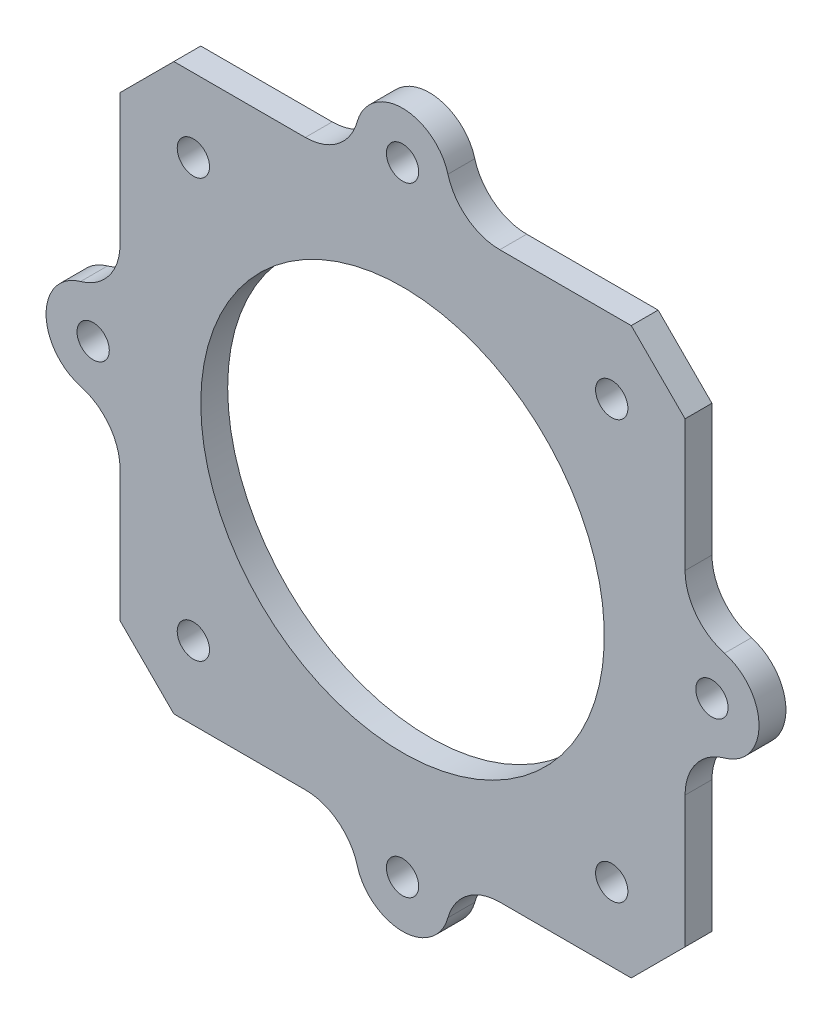
ISO-10303-21;
HEADER;
FILE_DESCRIPTION(('STEP AP214'),'2;1');
FILE_NAME('part.step','',(''),(''),'','','');
FILE_SCHEMA(('AUTOMOTIVE_DESIGN { 1 0 10303 214 1 1 1 1 }'));
ENDSEC;
DATA;
#1=APPLICATION_CONTEXT('core data for automotive mechanical design processes');
#2=APPLICATION_PROTOCOL_DEFINITION('international standard','automotive_design',2000,#1);
#3=PRODUCT_CONTEXT('',#1,'mechanical');
#4=PRODUCT('Part','Part','',(#3));
#5=PRODUCT_RELATED_PRODUCT_CATEGORY('part','',(#4));
#6=PRODUCT_DEFINITION_FORMATION('','',#4);
#7=PRODUCT_DEFINITION_CONTEXT('part definition',#1,'design');
#8=PRODUCT_DEFINITION('design','',#6,#7);
#9=PRODUCT_DEFINITION_SHAPE('','',#8);
#10=(LENGTH_UNIT() NAMED_UNIT(*) SI_UNIT(.MILLI.,.METRE.));
#11=(NAMED_UNIT(*) PLANE_ANGLE_UNIT() SI_UNIT($,.RADIAN.));
#12=(NAMED_UNIT(*) SI_UNIT($,.STERADIAN.) SOLID_ANGLE_UNIT());
#13=UNCERTAINTY_MEASURE_WITH_UNIT(LENGTH_MEASURE(1.E-05),#10,'distance_accuracy_value','');
#14=(GEOMETRIC_REPRESENTATION_CONTEXT(3) GLOBAL_UNCERTAINTY_ASSIGNED_CONTEXT((#13)) GLOBAL_UNIT_ASSIGNED_CONTEXT((#10,
#11,#12)) REPRESENTATION_CONTEXT('',''));
#15=CARTESIAN_POINT('',(0.,0.,0.));
#16=DIRECTION('',(0.,0.,1.));
#17=DIRECTION('',(1.,0.,0.));
#18=AXIS2_PLACEMENT_3D('',#15,#16,#17);
#19=CARTESIAN_POINT('',(21.,-21.,2.));
#20=DIRECTION('',(-1.,0.,0.));
#21=DIRECTION('',(0.,0.,1.));
#22=AXIS2_PLACEMENT_3D('',#19,#20,#21);
#23=PLANE('',#22);
#24=DIRECTION('',(0.,1.,0.));
#25=VECTOR('',#24,1.);
#26=CARTESIAN_POINT('',(21.,-21.,0.));
#27=LINE('',#26,#25);
#28=CARTESIAN_POINT('',(21.,-17.,0.));
#29=VERTEX_POINT('',#28);
#30=CARTESIAN_POINT('',(21.,-7.22841614740049,0.));
#31=VERTEX_POINT('',#30);
#32=EDGE_CURVE('E416',#29,#31,#27,.T.);
#33=ORIENTED_EDGE('',*,*,#32,.T.);
#34=DIRECTION('',(0.,0.,1.));
#35=VECTOR('',#34,1.);
#36=CARTESIAN_POINT('',(21.,-7.22841614740048,2.));
#37=LINE('',#36,#35);
#38=CARTESIAN_POINT('',(21.,-7.22841614740049,2.));
#39=VERTEX_POINT('',#38);
#40=EDGE_CURVE('E331',#31,#39,#37,.T.);
#41=ORIENTED_EDGE('',*,*,#40,.T.);
#42=DIRECTION('',(0.,1.,0.));
#43=VECTOR('',#42,1.);
#44=CARTESIAN_POINT('',(21.,-21.,2.));
#45=LINE('',#44,#43);
#46=CARTESIAN_POINT('',(21.,-17.,2.));
#47=VERTEX_POINT('',#46);
#48=EDGE_CURVE('E408',#47,#39,#45,.T.);
#49=ORIENTED_EDGE('',*,*,#48,.F.);
#50=DIRECTION('',(0.,0.,-1.));
#51=VECTOR('',#50,1.);
#52=CARTESIAN_POINT('',(21.,-17.,2.));
#53=LINE('',#52,#51);
#54=EDGE_CURVE('E292',#47,#29,#53,.T.);
#55=ORIENTED_EDGE('',*,*,#54,.T.);
#56=EDGE_LOOP('',(#33,#41,#49,#55));
#57=FACE_BOUND('',#56,.T.);
#58=ADVANCED_FACE('F43',(#57),#23,.F.);
#59=CARTESIAN_POINT('',(-21.,-21.,2.));
#60=DIRECTION('',(1.,0.,0.));
#61=DIRECTION('',(0.,0.,-1.));
#62=AXIS2_PLACEMENT_3D('',#59,#60,#61);
#63=PLANE('',#62);
#64=DIRECTION('',(0.,-1.,0.));
#65=VECTOR('',#64,1.);
#66=CARTESIAN_POINT('',(-21.,-21.,0.));
#67=LINE('',#66,#65);
#68=CARTESIAN_POINT('',(-21.,17.,0.));
#69=VERTEX_POINT('',#68);
#70=CARTESIAN_POINT('',(-21.,7.2284161474005,0.));
#71=VERTEX_POINT('',#70);
#72=EDGE_CURVE('E221',#69,#71,#67,.T.);
#73=ORIENTED_EDGE('',*,*,#72,.T.);
#74=DIRECTION('',(0.,0.,-1.));
#75=VECTOR('',#74,1.);
#76=CARTESIAN_POINT('',(-21.,7.22841614740051,2.));
#77=LINE('',#76,#75);
#78=CARTESIAN_POINT('',(-21.,7.2284161474005,2.));
#79=VERTEX_POINT('',#78);
#80=EDGE_CURVE('E303',#71,#79,#77,.F.);
#81=ORIENTED_EDGE('',*,*,#80,.T.);
#82=DIRECTION('',(0.,-1.,0.));
#83=VECTOR('',#82,1.);
#84=CARTESIAN_POINT('',(-21.,-21.,2.));
#85=LINE('',#84,#83);
#86=CARTESIAN_POINT('',(-21.,17.,2.));
#87=VERTEX_POINT('',#86);
#88=EDGE_CURVE('E224',#87,#79,#85,.T.);
#89=ORIENTED_EDGE('',*,*,#88,.F.);
#90=DIRECTION('',(0.,0.,-1.));
#91=VECTOR('',#90,1.);
#92=CARTESIAN_POINT('',(-21.,17.,2.));
#93=LINE('',#92,#91);
#94=EDGE_CURVE('E208',#87,#69,#93,.T.);
#95=ORIENTED_EDGE('',*,*,#94,.T.);
#96=EDGE_LOOP('',(#73,#81,#89,#95));
#97=FACE_BOUND('',#96,.T.);
#98=ADVANCED_FACE('F220',(#97),#63,.F.);
#99=CARTESIAN_POINT('',(-21.,-21.,2.));
#100=DIRECTION('',(0.,1.,0.));
#101=DIRECTION('',(0.,0.,1.));
#102=AXIS2_PLACEMENT_3D('',#99,#100,#101);
#103=PLANE('',#102);
#104=DIRECTION('',(1.,0.,0.));
#105=VECTOR('',#104,1.);
#106=CARTESIAN_POINT('',(-21.,-21.,2.));
#107=LINE('',#106,#105);
#108=CARTESIAN_POINT('',(7.22841614740045,-21.,2.));
#109=VERTEX_POINT('',#108);
#110=CARTESIAN_POINT('',(17.,-21.,2.));
#111=VERTEX_POINT('',#110);
#112=EDGE_CURVE('E395',#109,#111,#107,.T.);
#113=ORIENTED_EDGE('',*,*,#112,.F.);
#114=DIRECTION('',(0.,0.,-1.));
#115=VECTOR('',#114,1.);
#116=CARTESIAN_POINT('',(7.22841614740046,-21.,2.));
#117=LINE('',#116,#115);
#118=CARTESIAN_POINT('',(7.22841614740045,-21.,0.));
#119=VERTEX_POINT('',#118);
#120=EDGE_CURVE('E321',#109,#119,#117,.T.);
#121=ORIENTED_EDGE('',*,*,#120,.T.);
#122=DIRECTION('',(1.,0.,0.));
#123=VECTOR('',#122,1.);
#124=CARTESIAN_POINT('',(-21.,-21.,0.));
#125=LINE('',#124,#123);
#126=CARTESIAN_POINT('',(17.,-21.,0.));
#127=VERTEX_POINT('',#126);
#128=EDGE_CURVE('E235',#119,#127,#125,.T.);
#129=ORIENTED_EDGE('',*,*,#128,.T.);
#130=DIRECTION('',(0.,0.,1.));
#131=VECTOR('',#130,1.);
#132=CARTESIAN_POINT('',(17.,-21.,2.));
#133=LINE('',#132,#131);
#134=EDGE_CURVE('E280',#127,#111,#133,.T.);
#135=ORIENTED_EDGE('',*,*,#134,.T.);
#136=EDGE_LOOP('',(#113,#121,#129,#135));
#137=FACE_BOUND('',#136,.T.);
#138=ADVANCED_FACE('F547',(#137),#103,.F.);
#139=CARTESIAN_POINT('',(-21.,21.,2.));
#140=DIRECTION('',(0.,-1.,0.));
#141=DIRECTION('',(0.,0.,-1.));
#142=AXIS2_PLACEMENT_3D('',#139,#140,#141);
#143=PLANE('',#142);
#144=DIRECTION('',(-1.,0.,0.));
#145=VECTOR('',#144,1.);
#146=CARTESIAN_POINT('',(-21.,21.,2.));
#147=LINE('',#146,#145);
#148=CARTESIAN_POINT('',(-7.22841614740049,21.,2.));
#149=VERTEX_POINT('',#148);
#150=CARTESIAN_POINT('',(-17.,21.,2.));
#151=VERTEX_POINT('',#150);
#152=EDGE_CURVE('E405',#149,#151,#147,.T.);
#153=ORIENTED_EDGE('',*,*,#152,.F.);
#154=DIRECTION('',(0.,0.,1.));
#155=VECTOR('',#154,1.);
#156=CARTESIAN_POINT('',(-7.22841614740048,21.,0.));
#157=LINE('',#156,#155);
#158=CARTESIAN_POINT('',(-7.22841614740049,21.,0.));
#159=VERTEX_POINT('',#158);
#160=EDGE_CURVE('E65',#149,#159,#157,.F.);
#161=ORIENTED_EDGE('',*,*,#160,.T.);
#162=DIRECTION('',(-1.,0.,0.));
#163=VECTOR('',#162,1.);
#164=CARTESIAN_POINT('',(-21.,21.,0.));
#165=LINE('',#164,#163);
#166=CARTESIAN_POINT('',(-17.,21.,0.));
#167=VERTEX_POINT('',#166);
#168=EDGE_CURVE('E419',#159,#167,#165,.T.);
#169=ORIENTED_EDGE('',*,*,#168,.T.);
#170=DIRECTION('',(0.,0.,1.));
#171=VECTOR('',#170,1.);
#172=CARTESIAN_POINT('',(-17.,21.,2.));
#173=LINE('',#172,#171);
#174=EDGE_CURVE('E210',#167,#151,#173,.T.);
#175=ORIENTED_EDGE('',*,*,#174,.T.);
#176=EDGE_LOOP('',(#153,#161,#169,#175));
#177=FACE_BOUND('',#176,.T.);
#178=ADVANCED_FACE('F561',(#177),#143,.F.);
#179=CARTESIAN_POINT('',(21.,7.22841614740047,2.));
#180=VERTEX_POINT('',#179);
#181=CARTESIAN_POINT('',(21.,17.,2.));
#182=VERTEX_POINT('',#181);
#183=EDGE_CURVE('E248',#180,#182,#45,.T.);
#184=ORIENTED_EDGE('',*,*,#183,.F.);
#185=DIRECTION('',(0.,0.,1.));
#186=VECTOR('',#185,1.);
#187=CARTESIAN_POINT('',(21.,7.22841614740048,0.));
#188=LINE('',#187,#186);
#189=CARTESIAN_POINT('',(21.,7.22841614740047,0.));
#190=VERTEX_POINT('',#189);
#191=EDGE_CURVE('E334',#180,#190,#188,.F.);
#192=ORIENTED_EDGE('',*,*,#191,.T.);
#193=CARTESIAN_POINT('',(21.,17.,0.));
#194=VERTEX_POINT('',#193);
#195=EDGE_CURVE('E420',#190,#194,#27,.T.);
#196=ORIENTED_EDGE('',*,*,#195,.T.);
#197=DIRECTION('',(0.,0.,1.));
#198=VECTOR('',#197,1.);
#199=CARTESIAN_POINT('',(21.,17.,2.));
#200=LINE('',#199,#198);
#201=EDGE_CURVE('E288',#194,#182,#200,.T.);
#202=ORIENTED_EDGE('',*,*,#201,.T.);
#203=EDGE_LOOP('',(#184,#192,#196,#202));
#204=FACE_BOUND('',#203,.T.);
#205=ADVANCED_FACE('F552',(#204),#23,.F.);
#206=CARTESIAN_POINT('',(17.,21.,0.));
#207=VERTEX_POINT('',#206);
#208=CARTESIAN_POINT('',(7.22841614740047,21.,0.));
#209=VERTEX_POINT('',#208);
#210=EDGE_CURVE('E242',#207,#209,#165,.T.);
#211=ORIENTED_EDGE('',*,*,#210,.T.);
#212=DIRECTION('',(0.,0.,1.));
#213=VECTOR('',#212,1.);
#214=CARTESIAN_POINT('',(7.22841614740048,21.,2.));
#215=LINE('',#214,#213);
#216=CARTESIAN_POINT('',(7.22841614740047,21.,2.));
#217=VERTEX_POINT('',#216);
#218=EDGE_CURVE('E338',#209,#217,#215,.T.);
#219=ORIENTED_EDGE('',*,*,#218,.T.);
#220=CARTESIAN_POINT('',(17.,21.,2.));
#221=VERTEX_POINT('',#220);
#222=EDGE_CURVE('E402',#221,#217,#147,.T.);
#223=ORIENTED_EDGE('',*,*,#222,.F.);
#224=DIRECTION('',(0.,0.,-1.));
#225=VECTOR('',#224,1.);
#226=CARTESIAN_POINT('',(17.,21.,2.));
#227=LINE('',#226,#225);
#228=EDGE_CURVE('E214',#221,#207,#227,.T.);
#229=ORIENTED_EDGE('',*,*,#228,.T.);
#230=EDGE_LOOP('',(#211,#219,#223,#229));
#231=FACE_BOUND('',#230,.T.);
#232=ADVANCED_FACE('F560',(#231),#143,.F.);
#233=CARTESIAN_POINT('',(-21.,-7.22841614740046,2.));
#234=VERTEX_POINT('',#233);
#235=CARTESIAN_POINT('',(-21.,-17.,2.));
#236=VERTEX_POINT('',#235);
#237=EDGE_CURVE('E399',#234,#236,#85,.T.);
#238=ORIENTED_EDGE('',*,*,#237,.F.);
#239=DIRECTION('',(0.,0.,-1.));
#240=VECTOR('',#239,1.);
#241=CARTESIAN_POINT('',(-21.,-7.22841614740046,2.));
#242=LINE('',#241,#240);
#243=CARTESIAN_POINT('',(-21.,-7.22841614740046,0.));
#244=VERTEX_POINT('',#243);
#245=EDGE_CURVE('E306',#234,#244,#242,.T.);
#246=ORIENTED_EDGE('',*,*,#245,.T.);
#247=CARTESIAN_POINT('',(-21.,-17.,0.));
#248=VERTEX_POINT('',#247);
#249=EDGE_CURVE('E236',#244,#248,#67,.T.);
#250=ORIENTED_EDGE('',*,*,#249,.T.);
#251=DIRECTION('',(0.,0.,1.));
#252=VECTOR('',#251,1.);
#253=CARTESIAN_POINT('',(-21.,-17.,2.));
#254=LINE('',#253,#252);
#255=EDGE_CURVE('E227',#248,#236,#254,.T.);
#256=ORIENTED_EDGE('',*,*,#255,.T.);
#257=EDGE_LOOP('',(#238,#246,#250,#256));
#258=FACE_BOUND('',#257,.T.);
#259=ADVANCED_FACE('F544',(#258),#63,.F.);
#260=CARTESIAN_POINT('',(-17.,-21.,0.));
#261=VERTEX_POINT('',#260);
#262=CARTESIAN_POINT('',(-7.22841614740051,-21.,0.));
#263=VERTEX_POINT('',#262);
#264=EDGE_CURVE('E240',#261,#263,#125,.T.);
#265=ORIENTED_EDGE('',*,*,#264,.T.);
#266=DIRECTION('',(0.,0.,-1.));
#267=VECTOR('',#266,1.);
#268=CARTESIAN_POINT('',(-7.22841614740051,-21.,2.));
#269=LINE('',#268,#267);
#270=CARTESIAN_POINT('',(-7.22841614740051,-21.,2.));
#271=VERTEX_POINT('',#270);
#272=EDGE_CURVE('E310',#263,#271,#269,.F.);
#273=ORIENTED_EDGE('',*,*,#272,.T.);
#274=CARTESIAN_POINT('',(-17.,-21.,2.));
#275=VERTEX_POINT('',#274);
#276=EDGE_CURVE('E251',#275,#271,#107,.T.);
#277=ORIENTED_EDGE('',*,*,#276,.F.);
#278=DIRECTION('',(0.,0.,-1.));
#279=VECTOR('',#278,1.);
#280=CARTESIAN_POINT('',(-17.,-21.,2.));
#281=LINE('',#280,#279);
#282=EDGE_CURVE('E284',#275,#261,#281,.T.);
#283=ORIENTED_EDGE('',*,*,#282,.T.);
#284=EDGE_LOOP('',(#265,#273,#277,#283));
#285=FACE_BOUND('',#284,.T.);
#286=ADVANCED_FACE('F537',(#285),#103,.F.);
#287=CARTESIAN_POINT('',(0.,0.,2.));
#288=DIRECTION('',(0.,0.,-1.));
#289=DIRECTION('',(-1.,0.,0.));
#290=AXIS2_PLACEMENT_3D('',#287,#288,#289);
#291=PLANE('',#290);
#292=ORIENTED_EDGE('',*,*,#48,.T.);
#293=CARTESIAN_POINT('',(25.,-7.22841614740048,2.));
#294=DIRECTION('',(0.,0.,-1.));
#295=DIRECTION('',(-1.,0.,0.));
#296=AXIS2_PLACEMENT_3D('',#293,#294,#295);
#297=CIRCLE('',#296,4.);
#298=CARTESIAN_POINT('',(23.9333333333333,-3.3732608687869,2.));
#299=VERTEX_POINT('',#298);
#300=EDGE_CURVE('E377',#39,#299,#297,.T.);
#301=ORIENTED_EDGE('',*,*,#300,.T.);
#302=CARTESIAN_POINT('',(23.,0.,2.));
#303=DIRECTION('',(0.,0.,1.));
#304=DIRECTION('',(1.,0.,0.));
#305=AXIS2_PLACEMENT_3D('',#302,#303,#304);
#306=CIRCLE('',#305,3.5);
#307=CARTESIAN_POINT('',(23.9333333333333,3.37326086878689,2.));
#308=VERTEX_POINT('',#307);
#309=EDGE_CURVE('E509',#299,#308,#306,.T.);
#310=ORIENTED_EDGE('',*,*,#309,.T.);
#311=CARTESIAN_POINT('',(25.,7.22841614740048,2.));
#312=DIRECTION('',(0.,0.,-1.));
#313=DIRECTION('',(-1.,0.,0.));
#314=AXIS2_PLACEMENT_3D('',#311,#312,#313);
#315=CIRCLE('',#314,4.);
#316=EDGE_CURVE('E383',#308,#180,#315,.T.);
#317=ORIENTED_EDGE('',*,*,#316,.T.);
#318=ORIENTED_EDGE('',*,*,#183,.T.);
#319=DIRECTION('',(0.707106781186546,-0.707106781186549,0.));
#320=VECTOR('',#319,1.);
#321=CARTESIAN_POINT('',(17.,21.,2.));
#322=LINE('',#321,#320);
#323=EDGE_CURVE('E268',#182,#221,#322,.F.);
#324=ORIENTED_EDGE('',*,*,#323,.T.);
#325=ORIENTED_EDGE('',*,*,#222,.T.);
#326=CARTESIAN_POINT('',(7.22841614740048,25.,2.));
#327=DIRECTION('',(0.,0.,-1.));
#328=DIRECTION('',(-1.,0.,0.));
#329=AXIS2_PLACEMENT_3D('',#326,#327,#328);
#330=CIRCLE('',#329,4.);
#331=CARTESIAN_POINT('',(3.37326086878689,23.9333333333333,2.));
#332=VERTEX_POINT('',#331);
#333=EDGE_CURVE('E386',#217,#332,#330,.T.);
#334=ORIENTED_EDGE('',*,*,#333,.T.);
#335=CARTESIAN_POINT('',(0.,23.,2.));
#336=DIRECTION('',(0.,0.,1.));
#337=DIRECTION('',(1.,0.,0.));
#338=AXIS2_PLACEMENT_3D('',#335,#336,#337);
#339=CIRCLE('',#338,3.5);
#340=CARTESIAN_POINT('',(-3.37326086878689,23.9333333333333,2.));
#341=VERTEX_POINT('',#340);
#342=EDGE_CURVE('E469',#332,#341,#339,.T.);
#343=ORIENTED_EDGE('',*,*,#342,.T.);
#344=CARTESIAN_POINT('',(-7.22841614740048,25.,2.));
#345=DIRECTION('',(0.,0.,-1.));
#346=DIRECTION('',(-1.,0.,0.));
#347=AXIS2_PLACEMENT_3D('',#344,#345,#346);
#348=CIRCLE('',#347,4.);
#349=EDGE_CURVE('E52',#341,#149,#348,.T.);
#350=ORIENTED_EDGE('',*,*,#349,.T.);
#351=ORIENTED_EDGE('',*,*,#152,.T.);
#352=DIRECTION('',(0.707106781186549,0.707106781186546,0.));
#353=VECTOR('',#352,1.);
#354=CARTESIAN_POINT('',(-21.,17.,2.));
#355=LINE('',#354,#353);
#356=EDGE_CURVE('E277',#151,#87,#355,.F.);
#357=ORIENTED_EDGE('',*,*,#356,.T.);
#358=ORIENTED_EDGE('',*,*,#88,.T.);
#359=CARTESIAN_POINT('',(-25.,7.22841614740051,2.));
#360=DIRECTION('',(0.,0.,-1.));
#361=DIRECTION('',(-1.,0.,0.));
#362=AXIS2_PLACEMENT_3D('',#359,#360,#361);
#363=CIRCLE('',#362,4.);
#364=CARTESIAN_POINT('',(-23.9333333333333,3.37326086878692,2.));
#365=VERTEX_POINT('',#364);
#366=EDGE_CURVE('E353',#79,#365,#363,.T.);
#367=ORIENTED_EDGE('',*,*,#366,.T.);
#368=CARTESIAN_POINT('',(-23.,0.,2.));
#369=DIRECTION('',(0.,0.,1.));
#370=DIRECTION('',(1.,0.,0.));
#371=AXIS2_PLACEMENT_3D('',#368,#369,#370);
#372=CIRCLE('',#371,3.5);
#373=CARTESIAN_POINT('',(-23.9333333333333,-3.37326086878687,2.));
#374=VERTEX_POINT('',#373);
#375=EDGE_CURVE('E505',#374,#365,#372,.F.);
#376=ORIENTED_EDGE('',*,*,#375,.F.);
#377=CARTESIAN_POINT('',(-25.,-7.22841614740046,2.));
#378=DIRECTION('',(0.,0.,-1.));
#379=DIRECTION('',(-1.,0.,0.));
#380=AXIS2_PLACEMENT_3D('',#377,#378,#379);
#381=CIRCLE('',#380,4.);
#382=EDGE_CURVE('E359',#374,#234,#381,.T.);
#383=ORIENTED_EDGE('',*,*,#382,.T.);
#384=ORIENTED_EDGE('',*,*,#237,.T.);
#385=DIRECTION('',(-0.707106781186546,0.707106781186549,0.));
#386=VECTOR('',#385,1.);
#387=CARTESIAN_POINT('',(-17.,-21.,2.));
#388=LINE('',#387,#386);
#389=EDGE_CURVE('E274',#236,#275,#388,.F.);
#390=ORIENTED_EDGE('',*,*,#389,.T.);
#391=ORIENTED_EDGE('',*,*,#276,.T.);
#392=CARTESIAN_POINT('',(-7.22841614740051,-25.,2.));
#393=DIRECTION('',(0.,0.,-1.));
#394=DIRECTION('',(-1.,0.,0.));
#395=AXIS2_PLACEMENT_3D('',#392,#393,#394);
#396=CIRCLE('',#395,4.);
#397=CARTESIAN_POINT('',(-3.37326086878692,-23.9333333333333,2.));
#398=VERTEX_POINT('',#397);
#399=EDGE_CURVE('E362',#271,#398,#396,.T.);
#400=ORIENTED_EDGE('',*,*,#399,.T.);
#401=CARTESIAN_POINT('',(0.,-23.,2.));
#402=DIRECTION('',(0.,0.,1.));
#403=DIRECTION('',(1.,0.,0.));
#404=AXIS2_PLACEMENT_3D('',#401,#402,#403);
#405=CIRCLE('',#404,3.5);
#406=CARTESIAN_POINT('',(3.37326086878687,-23.9333333333333,2.));
#407=VERTEX_POINT('',#406);
#408=EDGE_CURVE('E489',#407,#398,#405,.F.);
#409=ORIENTED_EDGE('',*,*,#408,.F.);
#410=CARTESIAN_POINT('',(7.22841614740046,-25.,2.));
#411=DIRECTION('',(0.,0.,-1.));
#412=DIRECTION('',(-1.,0.,0.));
#413=AXIS2_PLACEMENT_3D('',#410,#411,#412);
#414=CIRCLE('',#413,4.);
#415=EDGE_CURVE('E368',#407,#109,#414,.T.);
#416=ORIENTED_EDGE('',*,*,#415,.T.);
#417=ORIENTED_EDGE('',*,*,#112,.T.);
#418=DIRECTION('',(-0.707106781186549,-0.707106781186546,0.));
#419=VECTOR('',#418,1.);
#420=CARTESIAN_POINT('',(21.,-17.,2.));
#421=LINE('',#420,#419);
#422=EDGE_CURVE('E271',#111,#47,#421,.F.);
#423=ORIENTED_EDGE('',*,*,#422,.T.);
#424=EDGE_LOOP('',(#292,#301,#310,#317,#318,#324,#325,#334,#343,#350,#351,#357,#358,#367,#376,
#383,#384,#390,#391,#400,#409,#416,#417,#423));
#425=FACE_BOUND('',#424,.T.);
#426=CARTESIAN_POINT('',(-23.,0.,2.));
#427=DIRECTION('',(0.,0.,1.));
#428=DIRECTION('',(1.,0.,0.));
#429=AXIS2_PLACEMENT_3D('',#426,#427,#428);
#430=CIRCLE('',#429,1.2);
#431=CARTESIAN_POINT('',(-21.8,0.,2.));
#432=VERTEX_POINT('',#431);
#433=EDGE_CURVE('E494',#432,#432,#430,.F.);
#434=ORIENTED_EDGE('',*,*,#433,.T.);
#435=EDGE_LOOP('',(#434));
#436=FACE_BOUND('',#435,.T.);
#437=CARTESIAN_POINT('',(0.,-23.,2.));
#438=DIRECTION('',(0.,0.,1.));
#439=DIRECTION('',(1.,0.,0.));
#440=AXIS2_PLACEMENT_3D('',#437,#438,#439);
#441=CIRCLE('',#440,1.2);
#442=CARTESIAN_POINT('',(1.19999999999998,-23.,2.));
#443=VERTEX_POINT('',#442);
#444=EDGE_CURVE('E479',#443,#443,#441,.F.);
#445=ORIENTED_EDGE('',*,*,#444,.T.);
#446=EDGE_LOOP('',(#445));
#447=FACE_BOUND('',#446,.T.);
#448=CARTESIAN_POINT('',(0.,0.,2.));
#449=DIRECTION('',(0.,0.,-1.));
#450=DIRECTION('',(-1.,0.,0.));
#451=AXIS2_PLACEMENT_3D('',#448,#449,#450);
#452=CIRCLE('',#451,15.);
#453=CARTESIAN_POINT('',(-15.,0.,2.));
#454=VERTEX_POINT('',#453);
#455=EDGE_CURVE('E455',#454,#454,#452,.T.);
#456=ORIENTED_EDGE('',*,*,#455,.T.);
#457=EDGE_LOOP('',(#456));
#458=FACE_BOUND('',#457,.T.);
#459=CARTESIAN_POINT('',(15.55,-15.55,2.));
#460=DIRECTION('',(0.,0.,-1.));
#461=DIRECTION('',(-1.,0.,0.));
#462=AXIS2_PLACEMENT_3D('',#459,#460,#461);
#463=CIRCLE('',#462,1.2);
#464=CARTESIAN_POINT('',(14.35,-15.55,2.));
#465=VERTEX_POINT('',#464);
#466=EDGE_CURVE('E414',#465,#465,#463,.T.);
#467=ORIENTED_EDGE('',*,*,#466,.T.);
#468=EDGE_LOOP('',(#467));
#469=FACE_BOUND('',#468,.T.);
#470=CARTESIAN_POINT('',(-15.55,-15.55,2.));
#471=DIRECTION('',(0.,0.,-1.));
#472=DIRECTION('',(-1.,0.,0.));
#473=AXIS2_PLACEMENT_3D('',#470,#471,#472);
#474=CIRCLE('',#473,1.2);
#475=CARTESIAN_POINT('',(-16.75,-15.55,2.));
#476=VERTEX_POINT('',#475);
#477=EDGE_CURVE('E429',#476,#476,#474,.T.);
#478=ORIENTED_EDGE('',*,*,#477,.T.);
#479=EDGE_LOOP('',(#478));
#480=FACE_BOUND('',#479,.T.);
#481=CARTESIAN_POINT('',(-15.55,15.55,2.));
#482=DIRECTION('',(0.,0.,-1.));
#483=DIRECTION('',(-1.,0.,0.));
#484=AXIS2_PLACEMENT_3D('',#481,#482,#483);
#485=CIRCLE('',#484,1.2);
#486=CARTESIAN_POINT('',(-16.75,15.55,2.));
#487=VERTEX_POINT('',#486);
#488=EDGE_CURVE('E434',#487,#487,#485,.T.);
#489=ORIENTED_EDGE('',*,*,#488,.T.);
#490=EDGE_LOOP('',(#489));
#491=FACE_BOUND('',#490,.T.);
#492=CARTESIAN_POINT('',(15.55,15.55,2.));
#493=DIRECTION('',(0.,0.,-1.));
#494=DIRECTION('',(-1.,0.,0.));
#495=AXIS2_PLACEMENT_3D('',#492,#493,#494);
#496=CIRCLE('',#495,1.2);
#497=CARTESIAN_POINT('',(14.35,15.55,2.));
#498=VERTEX_POINT('',#497);
#499=EDGE_CURVE('E439',#498,#498,#496,.T.);
#500=ORIENTED_EDGE('',*,*,#499,.T.);
#501=EDGE_LOOP('',(#500));
#502=FACE_BOUND('',#501,.T.);
#503=CARTESIAN_POINT('',(0.,23.,2.));
#504=DIRECTION('',(0.,0.,1.));
#505=DIRECTION('',(1.,0.,0.));
#506=AXIS2_PLACEMENT_3D('',#503,#504,#505);
#507=CIRCLE('',#506,1.2);
#508=CARTESIAN_POINT('',(1.2,23.,2.));
#509=VERTEX_POINT('',#508);
#510=EDGE_CURVE('E474',#509,#509,#507,.T.);
#511=ORIENTED_EDGE('',*,*,#510,.F.);
#512=EDGE_LOOP('',(#511));
#513=FACE_BOUND('',#512,.T.);
#514=CARTESIAN_POINT('',(23.,0.,2.));
#515=DIRECTION('',(0.,0.,1.));
#516=DIRECTION('',(1.,0.,0.));
#517=AXIS2_PLACEMENT_3D('',#514,#515,#516);
#518=CIRCLE('',#517,1.2);
#519=CARTESIAN_POINT('',(24.2,0.,2.));
#520=VERTEX_POINT('',#519);
#521=EDGE_CURVE('E520',#520,#520,#518,.T.);
#522=ORIENTED_EDGE('',*,*,#521,.F.);
#523=EDGE_LOOP('',(#522));
#524=FACE_BOUND('',#523,.T.);
#525=ADVANCED_FACE('F535',(#425,#436,#447,#458,#469,#480,#491,#502,#513,#524),#291,.F.);
#526=CARTESIAN_POINT('',(0.,0.,0.));
#527=DIRECTION('',(0.,0.,-1.));
#528=DIRECTION('',(-1.,0.,0.));
#529=AXIS2_PLACEMENT_3D('',#526,#527,#528);
#530=PLANE('',#529);
#531=ORIENTED_EDGE('',*,*,#195,.F.);
#532=CARTESIAN_POINT('',(25.,7.22841614740048,0.));
#533=DIRECTION('',(0.,0.,-1.));
#534=DIRECTION('',(-1.,0.,0.));
#535=AXIS2_PLACEMENT_3D('',#532,#533,#534);
#536=CIRCLE('',#535,4.);
#537=CARTESIAN_POINT('',(23.9333333333333,3.37326086878689,0.));
#538=VERTEX_POINT('',#537);
#539=EDGE_CURVE('E380',#190,#538,#536,.F.);
#540=ORIENTED_EDGE('',*,*,#539,.T.);
#541=CARTESIAN_POINT('',(23.,0.,0.));
#542=DIRECTION('',(0.,0.,1.));
#543=DIRECTION('',(1.,0.,0.));
#544=AXIS2_PLACEMENT_3D('',#541,#542,#543);
#545=CIRCLE('',#544,3.5);
#546=CARTESIAN_POINT('',(23.9333333333333,-3.3732608687869,0.));
#547=VERTEX_POINT('',#546);
#548=EDGE_CURVE('E516',#547,#538,#545,.T.);
#549=ORIENTED_EDGE('',*,*,#548,.F.);
#550=CARTESIAN_POINT('',(25.,-7.22841614740048,0.));
#551=DIRECTION('',(0.,0.,-1.));
#552=DIRECTION('',(-1.,0.,0.));
#553=AXIS2_PLACEMENT_3D('',#550,#551,#552);
#554=CIRCLE('',#553,4.);
#555=EDGE_CURVE('E374',#547,#31,#554,.F.);
#556=ORIENTED_EDGE('',*,*,#555,.T.);
#557=ORIENTED_EDGE('',*,*,#32,.F.);
#558=DIRECTION('',(0.707106781186549,0.707106781186546,0.));
#559=VECTOR('',#558,1.);
#560=CARTESIAN_POINT('',(19.,-19.,0.));
#561=LINE('',#560,#559);
#562=EDGE_CURVE('E256',#29,#127,#561,.F.);
#563=ORIENTED_EDGE('',*,*,#562,.T.);
#564=ORIENTED_EDGE('',*,*,#128,.F.);
#565=CARTESIAN_POINT('',(7.22841614740046,-25.,0.));
#566=DIRECTION('',(0.,0.,-1.));
#567=DIRECTION('',(-1.,0.,0.));
#568=AXIS2_PLACEMENT_3D('',#565,#566,#567);
#569=CIRCLE('',#568,4.);
#570=CARTESIAN_POINT('',(3.37326086878687,-23.9333333333333,0.));
#571=VERTEX_POINT('',#570);
#572=EDGE_CURVE('E371',#119,#571,#569,.F.);
#573=ORIENTED_EDGE('',*,*,#572,.T.);
#574=CARTESIAN_POINT('',(0.,-23.,0.));
#575=DIRECTION('',(0.,0.,1.));
#576=DIRECTION('',(1.,0.,0.));
#577=AXIS2_PLACEMENT_3D('',#574,#575,#576);
#578=CIRCLE('',#577,3.5);
#579=CARTESIAN_POINT('',(-3.37326086878692,-23.9333333333333,0.));
#580=VERTEX_POINT('',#579);
#581=EDGE_CURVE('E490',#571,#580,#578,.F.);
#582=ORIENTED_EDGE('',*,*,#581,.T.);
#583=CARTESIAN_POINT('',(-7.22841614740051,-25.,0.));
#584=DIRECTION('',(0.,0.,-1.));
#585=DIRECTION('',(-1.,0.,0.));
#586=AXIS2_PLACEMENT_3D('',#583,#584,#585);
#587=CIRCLE('',#586,4.);
#588=EDGE_CURVE('E365',#580,#263,#587,.F.);
#589=ORIENTED_EDGE('',*,*,#588,.T.);
#590=ORIENTED_EDGE('',*,*,#264,.F.);
#591=DIRECTION('',(0.707106781186546,-0.707106781186549,0.));
#592=VECTOR('',#591,1.);
#593=CARTESIAN_POINT('',(-19.,-19.,0.));
#594=LINE('',#593,#592);
#595=EDGE_CURVE('E215',#261,#248,#594,.F.);
#596=ORIENTED_EDGE('',*,*,#595,.T.);
#597=ORIENTED_EDGE('',*,*,#249,.F.);
#598=CARTESIAN_POINT('',(-25.,-7.22841614740046,0.));
#599=DIRECTION('',(0.,0.,-1.));
#600=DIRECTION('',(-1.,0.,0.));
#601=AXIS2_PLACEMENT_3D('',#598,#599,#600);
#602=CIRCLE('',#601,4.);
#603=CARTESIAN_POINT('',(-23.9333333333333,-3.37326086878687,0.));
#604=VERTEX_POINT('',#603);
#605=EDGE_CURVE('E356',#244,#604,#602,.F.);
#606=ORIENTED_EDGE('',*,*,#605,.T.);
#607=CARTESIAN_POINT('',(-23.,0.,0.));
#608=DIRECTION('',(0.,0.,1.));
#609=DIRECTION('',(1.,0.,0.));
#610=AXIS2_PLACEMENT_3D('',#607,#608,#609);
#611=CIRCLE('',#610,3.5);
#612=CARTESIAN_POINT('',(-23.9333333333333,3.37326086878692,0.));
#613=VERTEX_POINT('',#612);
#614=EDGE_CURVE('E506',#604,#613,#611,.F.);
#615=ORIENTED_EDGE('',*,*,#614,.T.);
#616=CARTESIAN_POINT('',(-25.,7.22841614740051,0.));
#617=DIRECTION('',(0.,0.,-1.));
#618=DIRECTION('',(-1.,0.,0.));
#619=AXIS2_PLACEMENT_3D('',#616,#617,#618);
#620=CIRCLE('',#619,4.);
#621=EDGE_CURVE('E233',#613,#71,#620,.F.);
#622=ORIENTED_EDGE('',*,*,#621,.T.);
#623=ORIENTED_EDGE('',*,*,#72,.F.);
#624=DIRECTION('',(-0.707106781186549,-0.707106781186546,0.));
#625=VECTOR('',#624,1.);
#626=CARTESIAN_POINT('',(-19.,19.,0.));
#627=LINE('',#626,#625);
#628=EDGE_CURVE('E204',#69,#167,#627,.F.);
#629=ORIENTED_EDGE('',*,*,#628,.T.);
#630=ORIENTED_EDGE('',*,*,#168,.F.);
#631=CARTESIAN_POINT('',(-7.22841614740048,25.,0.));
#632=DIRECTION('',(0.,0.,-1.));
#633=DIRECTION('',(-1.,0.,0.));
#634=AXIS2_PLACEMENT_3D('',#631,#632,#633);
#635=CIRCLE('',#634,4.);
#636=CARTESIAN_POINT('',(-3.37326086878689,23.9333333333333,0.));
#637=VERTEX_POINT('',#636);
#638=EDGE_CURVE('E11',#159,#637,#635,.F.);
#639=ORIENTED_EDGE('',*,*,#638,.T.);
#640=CARTESIAN_POINT('',(0.,23.,0.));
#641=DIRECTION('',(0.,0.,1.));
#642=DIRECTION('',(1.,0.,0.));
#643=AXIS2_PLACEMENT_3D('',#640,#641,#642);
#644=CIRCLE('',#643,3.5);
#645=CARTESIAN_POINT('',(3.37326086878689,23.9333333333333,0.));
#646=VERTEX_POINT('',#645);
#647=EDGE_CURVE('E470',#646,#637,#644,.T.);
#648=ORIENTED_EDGE('',*,*,#647,.F.);
#649=CARTESIAN_POINT('',(7.22841614740048,25.,0.));
#650=DIRECTION('',(0.,0.,-1.));
#651=DIRECTION('',(-1.,0.,0.));
#652=AXIS2_PLACEMENT_3D('',#649,#650,#651);
#653=CIRCLE('',#652,4.);
#654=EDGE_CURVE('E389',#646,#209,#653,.F.);
#655=ORIENTED_EDGE('',*,*,#654,.T.);
#656=ORIENTED_EDGE('',*,*,#210,.F.);
#657=DIRECTION('',(-0.707106781186546,0.707106781186549,0.));
#658=VECTOR('',#657,1.);
#659=CARTESIAN_POINT('',(19.,19.,0.));
#660=LINE('',#659,#658);
#661=EDGE_CURVE('E226',#207,#194,#660,.F.);
#662=ORIENTED_EDGE('',*,*,#661,.T.);
#663=EDGE_LOOP('',(#531,#540,#549,#556,#557,#563,#564,#573,#582,#589,#590,#596,#597,#606,#615,
#622,#623,#629,#630,#639,#648,#655,#656,#662));
#664=FACE_BOUND('',#663,.T.);
#665=CARTESIAN_POINT('',(0.,0.,0.));
#666=DIRECTION('',(0.,0.,-1.));
#667=DIRECTION('',(-1.,0.,0.));
#668=AXIS2_PLACEMENT_3D('',#665,#666,#667);
#669=CIRCLE('',#668,15.);
#670=CARTESIAN_POINT('',(-15.,0.,0.));
#671=VERTEX_POINT('',#670);
#672=EDGE_CURVE('E465',#671,#671,#669,.T.);
#673=ORIENTED_EDGE('',*,*,#672,.F.);
#674=EDGE_LOOP('',(#673));
#675=FACE_BOUND('',#674,.T.);
#676=CARTESIAN_POINT('',(15.55,-15.55,0.));
#677=DIRECTION('',(0.,0.,-1.));
#678=DIRECTION('',(1.,0.,0.));
#679=AXIS2_PLACEMENT_3D('',#676,#677,#678);
#680=CIRCLE('',#679,1.2);
#681=CARTESIAN_POINT('',(16.75,-15.55,0.));
#682=VERTEX_POINT('',#681);
#683=EDGE_CURVE('E450',#682,#682,#680,.T.);
#684=ORIENTED_EDGE('',*,*,#683,.F.);
#685=EDGE_LOOP('',(#684));
#686=FACE_BOUND('',#685,.T.);
#687=CARTESIAN_POINT('',(-15.55,-15.55,0.));
#688=DIRECTION('',(0.,0.,-1.));
#689=DIRECTION('',(-1.,0.,0.));
#690=AXIS2_PLACEMENT_3D('',#687,#688,#689);
#691=CIRCLE('',#690,1.2);
#692=CARTESIAN_POINT('',(-16.75,-15.55,0.));
#693=VERTEX_POINT('',#692);
#694=EDGE_CURVE('E454',#693,#693,#691,.T.);
#695=ORIENTED_EDGE('',*,*,#694,.F.);
#696=EDGE_LOOP('',(#695));
#697=FACE_BOUND('',#696,.T.);
#698=CARTESIAN_POINT('',(-15.55,15.55,0.));
#699=DIRECTION('',(0.,0.,-1.));
#700=DIRECTION('',(1.,0.,0.));
#701=AXIS2_PLACEMENT_3D('',#698,#699,#700);
#702=CIRCLE('',#701,1.2);
#703=CARTESIAN_POINT('',(-14.35,15.55,0.));
#704=VERTEX_POINT('',#703);
#705=EDGE_CURVE('E449',#704,#704,#702,.T.);
#706=ORIENTED_EDGE('',*,*,#705,.F.);
#707=EDGE_LOOP('',(#706));
#708=FACE_BOUND('',#707,.T.);
#709=CARTESIAN_POINT('',(15.55,15.55,0.));
#710=DIRECTION('',(0.,0.,-1.));
#711=DIRECTION('',(-1.,0.,0.));
#712=AXIS2_PLACEMENT_3D('',#709,#710,#711);
#713=CIRCLE('',#712,1.2);
#714=CARTESIAN_POINT('',(14.35,15.55,0.));
#715=VERTEX_POINT('',#714);
#716=EDGE_CURVE('E445',#715,#715,#713,.T.);
#717=ORIENTED_EDGE('',*,*,#716,.F.);
#718=EDGE_LOOP('',(#717));
#719=FACE_BOUND('',#718,.T.);
#720=CARTESIAN_POINT('',(0.,23.,0.));
#721=DIRECTION('',(0.,0.,1.));
#722=DIRECTION('',(1.,0.,0.));
#723=AXIS2_PLACEMENT_3D('',#720,#721,#722);
#724=CIRCLE('',#723,1.2);
#725=CARTESIAN_POINT('',(1.2,23.,0.));
#726=VERTEX_POINT('',#725);
#727=EDGE_CURVE('E475',#726,#726,#724,.T.);
#728=ORIENTED_EDGE('',*,*,#727,.T.);
#729=EDGE_LOOP('',(#728));
#730=FACE_BOUND('',#729,.T.);
#731=CARTESIAN_POINT('',(0.,-23.,0.));
#732=DIRECTION('',(0.,0.,1.));
#733=DIRECTION('',(1.,0.,0.));
#734=AXIS2_PLACEMENT_3D('',#731,#732,#733);
#735=CIRCLE('',#734,1.2);
#736=CARTESIAN_POINT('',(1.19999999999998,-23.,0.));
#737=VERTEX_POINT('',#736);
#738=EDGE_CURVE('E485',#737,#737,#735,.F.);
#739=ORIENTED_EDGE('',*,*,#738,.F.);
#740=EDGE_LOOP('',(#739));
#741=FACE_BOUND('',#740,.T.);
#742=CARTESIAN_POINT('',(-23.,0.,0.));
#743=DIRECTION('',(0.,0.,1.));
#744=DIRECTION('',(1.,0.,0.));
#745=AXIS2_PLACEMENT_3D('',#742,#743,#744);
#746=CIRCLE('',#745,1.2);
#747=CARTESIAN_POINT('',(-21.8,0.,0.));
#748=VERTEX_POINT('',#747);
#749=EDGE_CURVE('E501',#748,#748,#746,.F.);
#750=ORIENTED_EDGE('',*,*,#749,.F.);
#751=EDGE_LOOP('',(#750));
#752=FACE_BOUND('',#751,.T.);
#753=CARTESIAN_POINT('',(23.,0.,0.));
#754=DIRECTION('',(0.,0.,1.));
#755=DIRECTION('',(1.,0.,0.));
#756=AXIS2_PLACEMENT_3D('',#753,#754,#755);
#757=CIRCLE('',#756,1.2);
#758=CARTESIAN_POINT('',(24.2,0.,0.));
#759=VERTEX_POINT('',#758);
#760=EDGE_CURVE('E521',#759,#759,#757,.T.);
#761=ORIENTED_EDGE('',*,*,#760,.T.);
#762=EDGE_LOOP('',(#761));
#763=FACE_BOUND('',#762,.T.);
#764=ADVANCED_FACE('F230',(#664,#675,#686,#697,#708,#719,#730,#741,#752,#763),#530,.T.);
#765=CARTESIAN_POINT('',(-21.,17.,2.));
#766=DIRECTION('',(0.707106781186546,-0.707106781186549,0.));
#767=DIRECTION('',(0.,0.,-1.));
#768=AXIS2_PLACEMENT_3D('',#765,#766,#767);
#769=PLANE('',#768);
#770=ORIENTED_EDGE('',*,*,#356,.F.);
#771=ORIENTED_EDGE('',*,*,#174,.F.);
#772=ORIENTED_EDGE('',*,*,#628,.F.);
#773=ORIENTED_EDGE('',*,*,#94,.F.);
#774=EDGE_LOOP('',(#770,#771,#772,#773));
#775=FACE_BOUND('',#774,.T.);
#776=ADVANCED_FACE('F207',(#775),#769,.F.);
#777=CARTESIAN_POINT('',(-17.,-21.,2.));
#778=DIRECTION('',(0.707106781186549,0.707106781186546,0.));
#779=DIRECTION('',(0.,0.,-1.));
#780=AXIS2_PLACEMENT_3D('',#777,#778,#779);
#781=PLANE('',#780);
#782=ORIENTED_EDGE('',*,*,#389,.F.);
#783=ORIENTED_EDGE('',*,*,#255,.F.);
#784=ORIENTED_EDGE('',*,*,#595,.F.);
#785=ORIENTED_EDGE('',*,*,#282,.F.);
#786=EDGE_LOOP('',(#782,#783,#784,#785));
#787=FACE_BOUND('',#786,.T.);
#788=ADVANCED_FACE('F609',(#787),#781,.F.);
#789=CARTESIAN_POINT('',(21.,-17.,2.));
#790=DIRECTION('',(-0.707106781186546,0.707106781186549,0.));
#791=DIRECTION('',(0.,0.,-1.));
#792=AXIS2_PLACEMENT_3D('',#789,#790,#791);
#793=PLANE('',#792);
#794=ORIENTED_EDGE('',*,*,#422,.F.);
#795=ORIENTED_EDGE('',*,*,#134,.F.);
#796=ORIENTED_EDGE('',*,*,#562,.F.);
#797=ORIENTED_EDGE('',*,*,#54,.F.);
#798=EDGE_LOOP('',(#794,#795,#796,#797));
#799=FACE_BOUND('',#798,.T.);
#800=ADVANCED_FACE('F588',(#799),#793,.F.);
#801=CARTESIAN_POINT('',(17.,21.,2.));
#802=DIRECTION('',(-0.707106781186549,-0.707106781186546,0.));
#803=DIRECTION('',(0.,0.,-1.));
#804=AXIS2_PLACEMENT_3D('',#801,#802,#803);
#805=PLANE('',#804);
#806=ORIENTED_EDGE('',*,*,#323,.F.);
#807=ORIENTED_EDGE('',*,*,#201,.F.);
#808=ORIENTED_EDGE('',*,*,#661,.F.);
#809=ORIENTED_EDGE('',*,*,#228,.F.);
#810=EDGE_LOOP('',(#806,#807,#808,#809));
#811=FACE_BOUND('',#810,.T.);
#812=ADVANCED_FACE('F637',(#811),#805,.F.);
#813=CARTESIAN_POINT('',(15.55,15.55,2.5));
#814=DIRECTION('',(0.,0.,-1.));
#815=DIRECTION('',(-1.,0.,0.));
#816=AXIS2_PLACEMENT_3D('',#813,#814,#815);
#817=CYLINDRICAL_SURFACE('',#816,1.2);
#818=ORIENTED_EDGE('',*,*,#716,.T.);
#819=EDGE_LOOP('',(#818));
#820=FACE_BOUND('',#819,.T.);
#821=ORIENTED_EDGE('',*,*,#499,.F.);
#822=EDGE_LOOP('',(#821));
#823=FACE_BOUND('',#822,.T.);
#824=ADVANCED_FACE('F689',(#820,#823),#817,.F.);
#825=CARTESIAN_POINT('',(-15.55,15.55,2.5));
#826=DIRECTION('',(0.,0.,-1.));
#827=DIRECTION('',(-1.,0.,0.));
#828=AXIS2_PLACEMENT_3D('',#825,#826,#827);
#829=CYLINDRICAL_SURFACE('',#828,1.2);
#830=ORIENTED_EDGE('',*,*,#705,.T.);
#831=EDGE_LOOP('',(#830));
#832=FACE_BOUND('',#831,.T.);
#833=ORIENTED_EDGE('',*,*,#488,.F.);
#834=EDGE_LOOP('',(#833));
#835=FACE_BOUND('',#834,.T.);
#836=ADVANCED_FACE('F685',(#832,#835),#829,.F.);
#837=CARTESIAN_POINT('',(-15.55,-15.55,2.5));
#838=DIRECTION('',(0.,0.,-1.));
#839=DIRECTION('',(-1.,0.,0.));
#840=AXIS2_PLACEMENT_3D('',#837,#838,#839);
#841=CYLINDRICAL_SURFACE('',#840,1.2);
#842=ORIENTED_EDGE('',*,*,#694,.T.);
#843=EDGE_LOOP('',(#842));
#844=FACE_BOUND('',#843,.T.);
#845=ORIENTED_EDGE('',*,*,#477,.F.);
#846=EDGE_LOOP('',(#845));
#847=FACE_BOUND('',#846,.T.);
#848=ADVANCED_FACE('F688',(#844,#847),#841,.F.);
#849=CARTESIAN_POINT('',(15.55,-15.55,2.5));
#850=DIRECTION('',(0.,0.,-1.));
#851=DIRECTION('',(-1.,0.,0.));
#852=AXIS2_PLACEMENT_3D('',#849,#850,#851);
#853=CYLINDRICAL_SURFACE('',#852,1.2);
#854=ORIENTED_EDGE('',*,*,#683,.T.);
#855=EDGE_LOOP('',(#854));
#856=FACE_BOUND('',#855,.T.);
#857=ORIENTED_EDGE('',*,*,#466,.F.);
#858=EDGE_LOOP('',(#857));
#859=FACE_BOUND('',#858,.T.);
#860=ADVANCED_FACE('F679',(#856,#859),#853,.F.);
#861=CARTESIAN_POINT('',(0.,0.,2.5));
#862=DIRECTION('',(0.,0.,-1.));
#863=DIRECTION('',(-1.,0.,0.));
#864=AXIS2_PLACEMENT_3D('',#861,#862,#863);
#865=CYLINDRICAL_SURFACE('',#864,15.);
#866=ORIENTED_EDGE('',*,*,#672,.T.);
#867=EDGE_LOOP('',(#866));
#868=FACE_BOUND('',#867,.T.);
#869=ORIENTED_EDGE('',*,*,#455,.F.);
#870=EDGE_LOOP('',(#869));
#871=FACE_BOUND('',#870,.T.);
#872=ADVANCED_FACE('F671',(#868,#871),#865,.F.);
#873=CARTESIAN_POINT('',(0.,23.,2.));
#874=DIRECTION('',(0.,0.,-1.));
#875=DIRECTION('',(-1.,0.,0.));
#876=AXIS2_PLACEMENT_3D('',#873,#874,#875);
#877=CYLINDRICAL_SURFACE('',#876,3.5);
#878=ORIENTED_EDGE('',*,*,#342,.F.);
#879=DIRECTION('',(0.,0.,-1.));
#880=VECTOR('',#879,1.);
#881=CARTESIAN_POINT('',(3.37326086878689,23.9333333333333,2.));
#882=LINE('',#881,#880);
#883=EDGE_CURVE('E346',#332,#646,#882,.T.);
#884=ORIENTED_EDGE('',*,*,#883,.T.);
#885=ORIENTED_EDGE('',*,*,#647,.T.);
#886=DIRECTION('',(0.,0.,-1.));
#887=VECTOR('',#886,1.);
#888=CARTESIAN_POINT('',(-3.37326086878689,23.9333333333333,2.));
#889=LINE('',#888,#887);
#890=EDGE_CURVE('E342',#637,#341,#889,.F.);
#891=ORIENTED_EDGE('',*,*,#890,.T.);
#892=EDGE_LOOP('',(#878,#884,#885,#891));
#893=FACE_BOUND('',#892,.T.);
#894=ADVANCED_FACE('F666',(#893),#877,.T.);
#895=CARTESIAN_POINT('',(0.,23.,2.));
#896=DIRECTION('',(0.,0.,-1.));
#897=DIRECTION('',(-1.,0.,0.));
#898=AXIS2_PLACEMENT_3D('',#895,#896,#897);
#899=CYLINDRICAL_SURFACE('',#898,1.2);
#900=ORIENTED_EDGE('',*,*,#510,.T.);
#901=EDGE_LOOP('',(#900));
#902=FACE_BOUND('',#901,.T.);
#903=ORIENTED_EDGE('',*,*,#727,.F.);
#904=EDGE_LOOP('',(#903));
#905=FACE_BOUND('',#904,.T.);
#906=ADVANCED_FACE('F670',(#902,#905),#899,.F.);
#907=CARTESIAN_POINT('',(0.,-23.,2.));
#908=DIRECTION('',(0.,0.,-1.));
#909=DIRECTION('',(-1.,0.,0.));
#910=AXIS2_PLACEMENT_3D('',#907,#908,#909);
#911=CYLINDRICAL_SURFACE('',#910,3.5);
#912=ORIENTED_EDGE('',*,*,#408,.T.);
#913=DIRECTION('',(0.,0.,-1.));
#914=VECTOR('',#913,1.);
#915=CARTESIAN_POINT('',(-3.37326086878692,-23.9333333333333,2.));
#916=LINE('',#915,#914);
#917=EDGE_CURVE('E318',#398,#580,#916,.T.);
#918=ORIENTED_EDGE('',*,*,#917,.T.);
#919=ORIENTED_EDGE('',*,*,#581,.F.);
#920=DIRECTION('',(0.,0.,-1.));
#921=VECTOR('',#920,1.);
#922=CARTESIAN_POINT('',(3.37326086878687,-23.9333333333333,2.));
#923=LINE('',#922,#921);
#924=EDGE_CURVE('E314',#571,#407,#923,.F.);
#925=ORIENTED_EDGE('',*,*,#924,.T.);
#926=EDGE_LOOP('',(#912,#918,#919,#925));
#927=FACE_BOUND('',#926,.T.);
#928=ADVANCED_FACE('F598',(#927),#911,.T.);
#929=CARTESIAN_POINT('',(0.,-23.,2.));
#930=DIRECTION('',(0.,0.,-1.));
#931=DIRECTION('',(-1.,0.,0.));
#932=AXIS2_PLACEMENT_3D('',#929,#930,#931);
#933=CYLINDRICAL_SURFACE('',#932,1.2);
#934=ORIENTED_EDGE('',*,*,#444,.F.);
#935=EDGE_LOOP('',(#934));
#936=FACE_BOUND('',#935,.T.);
#937=ORIENTED_EDGE('',*,*,#738,.T.);
#938=EDGE_LOOP('',(#937));
#939=FACE_BOUND('',#938,.T.);
#940=ADVANCED_FACE('F726',(#936,#939),#933,.F.);
#941=CARTESIAN_POINT('',(-23.,0.,2.));
#942=DIRECTION('',(0.,0.,-1.));
#943=DIRECTION('',(-1.,0.,0.));
#944=AXIS2_PLACEMENT_3D('',#941,#942,#943);
#945=CYLINDRICAL_SURFACE('',#944,3.5);
#946=ORIENTED_EDGE('',*,*,#375,.T.);
#947=DIRECTION('',(0.,0.,-1.));
#948=VECTOR('',#947,1.);
#949=CARTESIAN_POINT('',(-23.9333333333333,3.37326086878692,2.));
#950=LINE('',#949,#948);
#951=EDGE_CURVE('E299',#365,#613,#950,.T.);
#952=ORIENTED_EDGE('',*,*,#951,.T.);
#953=ORIENTED_EDGE('',*,*,#614,.F.);
#954=DIRECTION('',(0.,0.,-1.));
#955=VECTOR('',#954,1.);
#956=CARTESIAN_POINT('',(-23.9333333333333,-3.37326086878687,2.));
#957=LINE('',#956,#955);
#958=EDGE_CURVE('E296',#604,#374,#957,.F.);
#959=ORIENTED_EDGE('',*,*,#958,.T.);
#960=EDGE_LOOP('',(#946,#952,#953,#959));
#961=FACE_BOUND('',#960,.T.);
#962=ADVANCED_FACE('F622',(#961),#945,.T.);
#963=CARTESIAN_POINT('',(-23.,0.,2.));
#964=DIRECTION('',(0.,0.,-1.));
#965=DIRECTION('',(-1.,0.,0.));
#966=AXIS2_PLACEMENT_3D('',#963,#964,#965);
#967=CYLINDRICAL_SURFACE('',#966,1.2);
#968=ORIENTED_EDGE('',*,*,#433,.F.);
#969=EDGE_LOOP('',(#968));
#970=FACE_BOUND('',#969,.T.);
#971=ORIENTED_EDGE('',*,*,#749,.T.);
#972=EDGE_LOOP('',(#971));
#973=FACE_BOUND('',#972,.T.);
#974=ADVANCED_FACE('F717',(#970,#973),#967,.F.);
#975=CARTESIAN_POINT('',(23.,0.,2.));
#976=DIRECTION('',(0.,0.,-1.));
#977=DIRECTION('',(-1.,0.,0.));
#978=AXIS2_PLACEMENT_3D('',#975,#976,#977);
#979=CYLINDRICAL_SURFACE('',#978,3.5);
#980=ORIENTED_EDGE('',*,*,#309,.F.);
#981=DIRECTION('',(0.,0.,-1.));
#982=VECTOR('',#981,1.);
#983=CARTESIAN_POINT('',(23.9333333333333,-3.3732608687869,2.));
#984=LINE('',#983,#982);
#985=EDGE_CURVE('E327',#299,#547,#984,.T.);
#986=ORIENTED_EDGE('',*,*,#985,.T.);
#987=ORIENTED_EDGE('',*,*,#548,.T.);
#988=DIRECTION('',(0.,0.,-1.));
#989=VECTOR('',#988,1.);
#990=CARTESIAN_POINT('',(23.9333333333333,3.37326086878689,2.));
#991=LINE('',#990,#989);
#992=EDGE_CURVE('E324',#538,#308,#991,.F.);
#993=ORIENTED_EDGE('',*,*,#992,.T.);
#994=EDGE_LOOP('',(#980,#986,#987,#993));
#995=FACE_BOUND('',#994,.T.);
#996=ADVANCED_FACE('F577',(#995),#979,.T.);
#997=CARTESIAN_POINT('',(23.,0.,2.));
#998=DIRECTION('',(0.,0.,-1.));
#999=DIRECTION('',(-1.,0.,0.));
#1000=AXIS2_PLACEMENT_3D('',#997,#998,#999);
#1001=CYLINDRICAL_SURFACE('',#1000,1.2);
#1002=ORIENTED_EDGE('',*,*,#521,.T.);
#1003=EDGE_LOOP('',(#1002));
#1004=FACE_BOUND('',#1003,.T.);
#1005=ORIENTED_EDGE('',*,*,#760,.F.);
#1006=EDGE_LOOP('',(#1005));
#1007=FACE_BOUND('',#1006,.T.);
#1008=ADVANCED_FACE('F532',(#1004,#1007),#1001,.F.);
#1009=CARTESIAN_POINT('',(-25.,7.22841614740051,2.));
#1010=DIRECTION('',(0.,0.,-1.));
#1011=DIRECTION('',(-1.,0.,0.));
#1012=AXIS2_PLACEMENT_3D('',#1009,#1010,#1011);
#1013=CYLINDRICAL_SURFACE('',#1012,4.);
#1014=ORIENTED_EDGE('',*,*,#366,.F.);
#1015=ORIENTED_EDGE('',*,*,#80,.F.);
#1016=ORIENTED_EDGE('',*,*,#621,.F.);
#1017=ORIENTED_EDGE('',*,*,#951,.F.);
#1018=EDGE_LOOP('',(#1014,#1015,#1016,#1017));
#1019=FACE_BOUND('',#1018,.T.);
#1020=ADVANCED_FACE('F626',(#1019),#1013,.F.);
#1021=CARTESIAN_POINT('',(-25.,-7.22841614740046,2.));
#1022=DIRECTION('',(0.,0.,-1.));
#1023=DIRECTION('',(-1.,0.,0.));
#1024=AXIS2_PLACEMENT_3D('',#1021,#1022,#1023);
#1025=CYLINDRICAL_SURFACE('',#1024,4.);
#1026=ORIENTED_EDGE('',*,*,#382,.F.);
#1027=ORIENTED_EDGE('',*,*,#958,.F.);
#1028=ORIENTED_EDGE('',*,*,#605,.F.);
#1029=ORIENTED_EDGE('',*,*,#245,.F.);
#1030=EDGE_LOOP('',(#1026,#1027,#1028,#1029));
#1031=FACE_BOUND('',#1030,.T.);
#1032=ADVANCED_FACE('F618',(#1031),#1025,.F.);
#1033=CARTESIAN_POINT('',(-7.22841614740051,-25.,2.));
#1034=DIRECTION('',(0.,0.,-1.));
#1035=DIRECTION('',(-1.,0.,0.));
#1036=AXIS2_PLACEMENT_3D('',#1033,#1034,#1035);
#1037=CYLINDRICAL_SURFACE('',#1036,4.);
#1038=ORIENTED_EDGE('',*,*,#588,.F.);
#1039=ORIENTED_EDGE('',*,*,#917,.F.);
#1040=ORIENTED_EDGE('',*,*,#399,.F.);
#1041=ORIENTED_EDGE('',*,*,#272,.F.);
#1042=EDGE_LOOP('',(#1038,#1039,#1040,#1041));
#1043=FACE_BOUND('',#1042,.T.);
#1044=ADVANCED_FACE('F602',(#1043),#1037,.F.);
#1045=CARTESIAN_POINT('',(7.22841614740046,-25.,2.));
#1046=DIRECTION('',(0.,0.,-1.));
#1047=DIRECTION('',(-1.,0.,0.));
#1048=AXIS2_PLACEMENT_3D('',#1045,#1046,#1047);
#1049=CYLINDRICAL_SURFACE('',#1048,4.);
#1050=ORIENTED_EDGE('',*,*,#572,.F.);
#1051=ORIENTED_EDGE('',*,*,#120,.F.);
#1052=ORIENTED_EDGE('',*,*,#415,.F.);
#1053=ORIENTED_EDGE('',*,*,#924,.F.);
#1054=EDGE_LOOP('',(#1050,#1051,#1052,#1053));
#1055=FACE_BOUND('',#1054,.T.);
#1056=ADVANCED_FACE('F593',(#1055),#1049,.F.);
#1057=CARTESIAN_POINT('',(25.,-7.22841614740048,2.));
#1058=DIRECTION('',(0.,0.,-1.));
#1059=DIRECTION('',(-1.,0.,0.));
#1060=AXIS2_PLACEMENT_3D('',#1057,#1058,#1059);
#1061=CYLINDRICAL_SURFACE('',#1060,4.);
#1062=ORIENTED_EDGE('',*,*,#300,.F.);
#1063=ORIENTED_EDGE('',*,*,#40,.F.);
#1064=ORIENTED_EDGE('',*,*,#555,.F.);
#1065=ORIENTED_EDGE('',*,*,#985,.F.);
#1066=EDGE_LOOP('',(#1062,#1063,#1064,#1065));
#1067=FACE_BOUND('',#1066,.T.);
#1068=ADVANCED_FACE('F581',(#1067),#1061,.F.);
#1069=CARTESIAN_POINT('',(25.,7.22841614740048,2.));
#1070=DIRECTION('',(0.,0.,-1.));
#1071=DIRECTION('',(-1.,0.,0.));
#1072=AXIS2_PLACEMENT_3D('',#1069,#1070,#1071);
#1073=CYLINDRICAL_SURFACE('',#1072,4.);
#1074=ORIENTED_EDGE('',*,*,#316,.F.);
#1075=ORIENTED_EDGE('',*,*,#992,.F.);
#1076=ORIENTED_EDGE('',*,*,#539,.F.);
#1077=ORIENTED_EDGE('',*,*,#191,.F.);
#1078=EDGE_LOOP('',(#1074,#1075,#1076,#1077));
#1079=FACE_BOUND('',#1078,.T.);
#1080=ADVANCED_FACE('F572',(#1079),#1073,.F.);
#1081=CARTESIAN_POINT('',(7.22841614740048,25.,2.));
#1082=DIRECTION('',(0.,0.,-1.));
#1083=DIRECTION('',(-1.,0.,0.));
#1084=AXIS2_PLACEMENT_3D('',#1081,#1082,#1083);
#1085=CYLINDRICAL_SURFACE('',#1084,4.);
#1086=ORIENTED_EDGE('',*,*,#654,.F.);
#1087=ORIENTED_EDGE('',*,*,#883,.F.);
#1088=ORIENTED_EDGE('',*,*,#333,.F.);
#1089=ORIENTED_EDGE('',*,*,#218,.F.);
#1090=EDGE_LOOP('',(#1086,#1087,#1088,#1089));
#1091=FACE_BOUND('',#1090,.T.);
#1092=ADVANCED_FACE('F647',(#1091),#1085,.F.);
#1093=CARTESIAN_POINT('',(-7.22841614740048,25.,2.));
#1094=DIRECTION('',(0.,0.,-1.));
#1095=DIRECTION('',(-1.,0.,0.));
#1096=AXIS2_PLACEMENT_3D('',#1093,#1094,#1095);
#1097=CYLINDRICAL_SURFACE('',#1096,4.);
#1098=ORIENTED_EDGE('',*,*,#638,.F.);
#1099=ORIENTED_EDGE('',*,*,#160,.F.);
#1100=ORIENTED_EDGE('',*,*,#349,.F.);
#1101=ORIENTED_EDGE('',*,*,#890,.F.);
#1102=EDGE_LOOP('',(#1098,#1099,#1100,#1101));
#1103=FACE_BOUND('',#1102,.T.);
#1104=ADVANCED_FACE('F45',(#1103),#1097,.F.);
#1105=CLOSED_SHELL('',(#58,#98,#138,#178,#205,#232,#259,#286,#525,#764,#776,#788,#800,#812,#824,
#836,#848,#860,#872,#894,#906,#928,#940,#962,#974,#996,#1008,#1020,#1032,#1044,#1056,#1068,
#1080,#1092,#1104));
#1106=MANIFOLD_SOLID_BREP('B2',#1105);
#1107=ADVANCED_BREP_SHAPE_REPRESENTATION('',(#18,#1106),#14);
#1108=SHAPE_DEFINITION_REPRESENTATION(#9,#1107);
ENDSEC;
END-ISO-10303-21;
